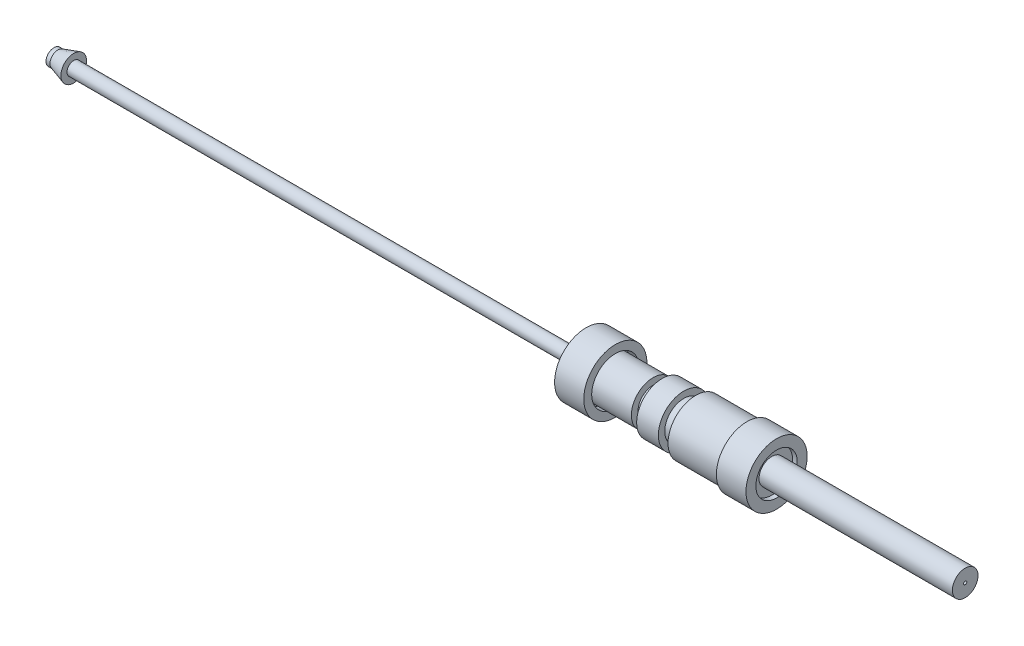
ISO-10303-21;
HEADER;
FILE_DESCRIPTION(('STEP AP214'),'2;1');
FILE_NAME('part.step','',(''),(''),'','','');
FILE_SCHEMA(('AUTOMOTIVE_DESIGN { 1 0 10303 214 1 1 1 1 }'));
ENDSEC;
DATA;
#1=APPLICATION_CONTEXT('core data for automotive mechanical design processes');
#2=APPLICATION_PROTOCOL_DEFINITION('international standard','automotive_design',2000,#1);
#3=PRODUCT_CONTEXT('',#1,'mechanical');
#4=PRODUCT('Part','Part','',(#3));
#5=PRODUCT_RELATED_PRODUCT_CATEGORY('part','',(#4));
#6=PRODUCT_DEFINITION_FORMATION('','',#4);
#7=PRODUCT_DEFINITION_CONTEXT('part definition',#1,'design');
#8=PRODUCT_DEFINITION('design','',#6,#7);
#9=PRODUCT_DEFINITION_SHAPE('','',#8);
#10=(LENGTH_UNIT() NAMED_UNIT(*) SI_UNIT(.MILLI.,.METRE.));
#11=(NAMED_UNIT(*) PLANE_ANGLE_UNIT() SI_UNIT($,.RADIAN.));
#12=(NAMED_UNIT(*) SI_UNIT($,.STERADIAN.) SOLID_ANGLE_UNIT());
#13=UNCERTAINTY_MEASURE_WITH_UNIT(LENGTH_MEASURE(1.E-05),#10,'distance_accuracy_value','');
#14=(GEOMETRIC_REPRESENTATION_CONTEXT(3) GLOBAL_UNCERTAINTY_ASSIGNED_CONTEXT((#13)) GLOBAL_UNIT_ASSIGNED_CONTEXT((#10,
#11,#12)) REPRESENTATION_CONTEXT('',''));
#15=CARTESIAN_POINT('',(0.,0.,0.));
#16=DIRECTION('',(0.,0.,1.));
#17=DIRECTION('',(1.,0.,0.));
#18=AXIS2_PLACEMENT_3D('',#15,#16,#17);
#19=CARTESIAN_POINT('',(209.759322266684,0.,0.));
#20=DIRECTION('',(1.,0.,0.));
#21=DIRECTION('',(0.,0.,-1.));
#22=AXIS2_PLACEMENT_3D('',#19,#20,#21);
#23=PLANE('',#22);
#24=CARTESIAN_POINT('',(209.759322266684,-148.573704322227,0.));
#25=DIRECTION('',(-1.,0.,0.));
#26=DIRECTION('',(0.,0.,1.));
#27=AXIS2_PLACEMENT_3D('',#24,#25,#26);
#28=CIRCLE('',#27,1.70000000000001);
#29=CARTESIAN_POINT('',(209.759322266684,-148.573704322227,1.70000000000001));
#30=VERTEX_POINT('',#29);
#31=EDGE_CURVE('E103',#30,#30,#28,.T.);
#32=ORIENTED_EDGE('',*,*,#31,.F.);
#33=EDGE_LOOP('',(#32));
#34=FACE_BOUND('',#33,.T.);
#35=CARTESIAN_POINT('',(209.759322266684,-148.573704322227,0.));
#36=DIRECTION('',(-1.,0.,0.));
#37=DIRECTION('',(0.,0.,1.));
#38=AXIS2_PLACEMENT_3D('',#35,#36,#37);
#39=CIRCLE('',#38,3.25);
#40=CARTESIAN_POINT('',(209.759322266684,-148.573704322227,3.25));
#41=VERTEX_POINT('',#40);
#42=EDGE_CURVE('E148',#41,#41,#39,.T.);
#43=ORIENTED_EDGE('',*,*,#42,.T.);
#44=EDGE_LOOP('',(#43));
#45=FACE_BOUND('',#44,.T.);
#46=ADVANCED_FACE('F32',(#34,#45),#23,.F.);
#47=CARTESIAN_POINT('',(227.370475165962,-148.573704322227,0.));
#48=DIRECTION('',(-1.,0.,0.));
#49=DIRECTION('',(0.,0.,1.));
#50=AXIS2_PLACEMENT_3D('',#47,#48,#49);
#51=CYLINDRICAL_SURFACE('',#50,3.25);
#52=CARTESIAN_POINT('',(300.659322266684,-148.573704322227,0.));
#53=DIRECTION('',(-1.,0.,0.));
#54=DIRECTION('',(0.,0.,1.));
#55=AXIS2_PLACEMENT_3D('',#52,#53,#54);
#56=CIRCLE('',#55,3.25);
#57=CARTESIAN_POINT('',(300.659322266684,-148.573704322227,3.25));
#58=VERTEX_POINT('',#57);
#59=EDGE_CURVE('E10',#58,#58,#56,.T.);
#60=ORIENTED_EDGE('',*,*,#59,.T.);
#61=EDGE_LOOP('',(#60));
#62=FACE_BOUND('',#61,.T.);
#63=CARTESIAN_POINT('',(251.659322266684,-148.573704322227,0.));
#64=DIRECTION('',(-1.,0.,0.));
#65=DIRECTION('',(0.,0.,1.));
#66=AXIS2_PLACEMENT_3D('',#63,#64,#65);
#67=CIRCLE('',#66,3.25);
#68=CARTESIAN_POINT('',(251.659322266684,-148.573704322227,3.25));
#69=VERTEX_POINT('',#68);
#70=EDGE_CURVE('E127',#69,#69,#67,.T.);
#71=ORIENTED_EDGE('',*,*,#70,.F.);
#72=EDGE_LOOP('',(#71));
#73=FACE_BOUND('',#72,.T.);
#74=ADVANCED_FACE('F34',(#62,#73),#51,.T.);
#75=CARTESIAN_POINT('',(300.659322266684,-145.323704322227,0.));
#76=DIRECTION('',(1.,0.,0.));
#77=DIRECTION('',(0.,0.,-1.));
#78=AXIS2_PLACEMENT_3D('',#75,#76,#77);
#79=PLANE('',#78);
#80=CARTESIAN_POINT('',(300.659322266684,-148.573704322227,0.));
#81=DIRECTION('',(-1.,0.,0.));
#82=DIRECTION('',(0.,0.,1.));
#83=AXIS2_PLACEMENT_3D('',#80,#81,#82);
#84=CIRCLE('',#83,0.400000000000011);
#85=CARTESIAN_POINT('',(300.659322266684,-148.573704322227,0.400000000000011));
#86=VERTEX_POINT('',#85);
#87=EDGE_CURVE('E39',#86,#86,#84,.T.);
#88=ORIENTED_EDGE('',*,*,#87,.T.);
#89=EDGE_LOOP('',(#88));
#90=FACE_BOUND('',#89,.T.);
#91=ORIENTED_EDGE('',*,*,#59,.F.);
#92=EDGE_LOOP('',(#91));
#93=FACE_BOUND('',#92,.T.);
#94=ADVANCED_FACE('F178',(#90,#93),#79,.T.);
#95=CARTESIAN_POINT('',(227.370475165962,-148.573704322227,0.));
#96=DIRECTION('',(-1.,0.,0.));
#97=DIRECTION('',(0.,0.,1.));
#98=AXIS2_PLACEMENT_3D('',#95,#96,#97);
#99=CYLINDRICAL_SURFACE('',#98,0.400000000000011);
#100=CARTESIAN_POINT('',(284.559322266684,-148.573704322227,0.));
#101=DIRECTION('',(-1.,0.,0.));
#102=DIRECTION('',(0.,0.,1.));
#103=AXIS2_PLACEMENT_3D('',#100,#101,#102);
#104=CIRCLE('',#103,0.400000000000011);
#105=CARTESIAN_POINT('',(284.559322266684,-148.573704322227,0.400000000000011));
#106=VERTEX_POINT('',#105);
#107=EDGE_CURVE('E43',#106,#106,#104,.T.);
#108=ORIENTED_EDGE('',*,*,#107,.T.);
#109=EDGE_LOOP('',(#108));
#110=FACE_BOUND('',#109,.T.);
#111=ORIENTED_EDGE('',*,*,#87,.F.);
#112=EDGE_LOOP('',(#111));
#113=FACE_BOUND('',#112,.T.);
#114=ADVANCED_FACE('F252',(#110,#113),#99,.F.);
#115=CARTESIAN_POINT('',(284.559322266684,-148.173704322227,0.));
#116=DIRECTION('',(-1.,0.,0.));
#117=DIRECTION('',(0.,0.,1.));
#118=AXIS2_PLACEMENT_3D('',#115,#116,#117);
#119=PLANE('',#118);
#120=CARTESIAN_POINT('',(284.559322266684,-148.573704322227,0.));
#121=DIRECTION('',(-1.,0.,0.));
#122=DIRECTION('',(0.,0.,1.));
#123=AXIS2_PLACEMENT_3D('',#120,#121,#122);
#124=CIRCLE('',#123,1.70245172341896);
#125=CARTESIAN_POINT('',(284.559322266684,-148.573704322227,1.70245172341896));
#126=VERTEX_POINT('',#125);
#127=EDGE_CURVE('E47',#126,#126,#124,.T.);
#128=ORIENTED_EDGE('',*,*,#127,.T.);
#129=EDGE_LOOP('',(#128));
#130=FACE_BOUND('',#129,.T.);
#131=ORIENTED_EDGE('',*,*,#107,.F.);
#132=EDGE_LOOP('',(#131));
#133=FACE_BOUND('',#132,.T.);
#134=ADVANCED_FACE('F248',(#130,#133),#119,.T.);
#135=CARTESIAN_POINT('',(284.559322266684,-148.573704322227,0.));
#136=DIRECTION('',(1.,0.,0.));
#137=DIRECTION('',(0.,0.,-1.));
#138=AXIS2_PLACEMENT_3D('',#135,#136,#137);
#139=CONICAL_SURFACE('',#138,1.70245172341896,4.81674541660942E-05);
#140=CARTESIAN_POINT('',(233.659322266684,-148.573704322227,0.));
#141=DIRECTION('',(-1.,0.,0.));
#142=DIRECTION('',(0.,0.,1.));
#143=AXIS2_PLACEMENT_3D('',#140,#141,#142);
#144=CIRCLE('',#143,1.70000000000001);
#145=CARTESIAN_POINT('',(233.659322266684,-148.573704322227,1.70000000000001));
#146=VERTEX_POINT('',#145);
#147=EDGE_CURVE('E52',#146,#146,#144,.T.);
#148=ORIENTED_EDGE('',*,*,#147,.T.);
#149=EDGE_LOOP('',(#148));
#150=FACE_BOUND('',#149,.T.);
#151=ORIENTED_EDGE('',*,*,#127,.F.);
#152=EDGE_LOOP('',(#151));
#153=FACE_BOUND('',#152,.T.);
#154=ADVANCED_FACE('F241',(#150,#153),#139,.F.);
#155=CARTESIAN_POINT('',(233.659322266684,0.,0.));
#156=DIRECTION('',(-1.,0.,0.));
#157=DIRECTION('',(0.,0.,1.));
#158=AXIS2_PLACEMENT_3D('',#155,#156,#157);
#159=PLANE('',#158);
#160=CARTESIAN_POINT('',(233.659322266684,-148.573704322227,0.));
#161=DIRECTION('',(-1.,0.,0.));
#162=DIRECTION('',(0.,0.,1.));
#163=AXIS2_PLACEMENT_3D('',#160,#161,#162);
#164=CIRCLE('',#163,0.404096618150496);
#165=CARTESIAN_POINT('',(233.659322266684,-148.573704322227,0.404096618150496));
#166=VERTEX_POINT('',#165);
#167=EDGE_CURVE('E55',#166,#166,#164,.T.);
#168=ORIENTED_EDGE('',*,*,#167,.T.);
#169=EDGE_LOOP('',(#168));
#170=FACE_BOUND('',#169,.T.);
#171=ORIENTED_EDGE('',*,*,#147,.F.);
#172=EDGE_LOOP('',(#171));
#173=FACE_BOUND('',#172,.T.);
#174=ADVANCED_FACE('F238',(#170,#173),#159,.F.);
#175=CARTESIAN_POINT('',(227.370475165962,-148.573704322227,0.));
#176=DIRECTION('',(-1.,0.,0.));
#177=DIRECTION('',(0.,0.,1.));
#178=AXIS2_PLACEMENT_3D('',#175,#176,#177);
#179=CYLINDRICAL_SURFACE('',#178,0.404096618150496);
#180=ORIENTED_EDGE('',*,*,#167,.F.);
#181=EDGE_LOOP('',(#180));
#182=FACE_BOUND('',#181,.T.);
#183=CARTESIAN_POINT('',(222.632765812238,-148.573704322227,0.));
#184=DIRECTION('',(-1.,0.,0.));
#185=DIRECTION('',(0.,0.,1.));
#186=AXIS2_PLACEMENT_3D('',#183,#184,#185);
#187=CIRCLE('',#186,0.404096618150496);
#188=CARTESIAN_POINT('',(222.632765812238,-148.573704322227,0.404096618150496));
#189=VERTEX_POINT('',#188);
#190=EDGE_CURVE('E100',#189,#189,#187,.T.);
#191=ORIENTED_EDGE('',*,*,#190,.T.);
#192=EDGE_LOOP('',(#191));
#193=FACE_BOUND('',#192,.T.);
#194=ADVANCED_FACE('F236',(#182,#193),#179,.F.);
#195=CARTESIAN_POINT('',(227.370475165962,-148.573704322227,0.));
#196=DIRECTION('',(-1.,0.,0.));
#197=DIRECTION('',(0.,0.,1.));
#198=AXIS2_PLACEMENT_3D('',#195,#196,#197);
#199=CYLINDRICAL_SURFACE('',#198,7.00000000000001);
#200=CARTESIAN_POINT('',(232.359322266684,-148.573704322227,0.));
#201=DIRECTION('',(-1.,0.,0.));
#202=DIRECTION('',(0.,0.,1.));
#203=AXIS2_PLACEMENT_3D('',#200,#201,#202);
#204=CIRCLE('',#203,7.00000000000001);
#205=CARTESIAN_POINT('',(232.359322266684,-148.573704322227,7.00000000000001));
#206=VERTEX_POINT('',#205);
#207=EDGE_CURVE('E58',#206,#206,#204,.T.);
#208=ORIENTED_EDGE('',*,*,#207,.F.);
#209=EDGE_LOOP('',(#208));
#210=FACE_BOUND('',#209,.T.);
#211=CARTESIAN_POINT('',(245.359322266684,-148.573704322227,0.));
#212=DIRECTION('',(1.,0.,0.));
#213=DIRECTION('',(0.,0.,-1.));
#214=AXIS2_PLACEMENT_3D('',#211,#212,#213);
#215=CIRCLE('',#214,7.00000000000001);
#216=CARTESIAN_POINT('',(245.359322266684,-148.573704322227,-7.00000000000001));
#217=VERTEX_POINT('',#216);
#218=EDGE_CURVE('E121',#217,#217,#215,.T.);
#219=ORIENTED_EDGE('',*,*,#218,.F.);
#220=EDGE_LOOP('',(#219));
#221=FACE_BOUND('',#220,.T.);
#222=ADVANCED_FACE('F232',(#210,#221),#199,.T.);
#223=CARTESIAN_POINT('',(232.359322266684,0.,0.));
#224=DIRECTION('',(1.,0.,0.));
#225=DIRECTION('',(0.,0.,-1.));
#226=AXIS2_PLACEMENT_3D('',#223,#224,#225);
#227=PLANE('',#226);
#228=CARTESIAN_POINT('',(232.359322266684,-148.573704322227,0.));
#229=DIRECTION('',(-1.,0.,0.));
#230=DIRECTION('',(0.,0.,1.));
#231=AXIS2_PLACEMENT_3D('',#228,#229,#230);
#232=CIRCLE('',#231,4.83456323534207);
#233=CARTESIAN_POINT('',(232.359322266684,-148.573704322227,4.83456323534207));
#234=VERTEX_POINT('',#233);
#235=EDGE_CURVE('E61',#234,#234,#232,.T.);
#236=ORIENTED_EDGE('',*,*,#235,.F.);
#237=EDGE_LOOP('',(#236));
#238=FACE_BOUND('',#237,.T.);
#239=ORIENTED_EDGE('',*,*,#207,.T.);
#240=EDGE_LOOP('',(#239));
#241=FACE_BOUND('',#240,.T.);
#242=ADVANCED_FACE('F228',(#238,#241),#227,.F.);
#243=CARTESIAN_POINT('',(227.370475165962,-148.573704322227,0.));
#244=DIRECTION('',(-1.,0.,0.));
#245=DIRECTION('',(0.,0.,1.));
#246=AXIS2_PLACEMENT_3D('',#243,#244,#245);
#247=CYLINDRICAL_SURFACE('',#246,4.83456323534207);
#248=CARTESIAN_POINT('',(229.359322266684,-148.573704322227,0.));
#249=DIRECTION('',(-1.,0.,0.));
#250=DIRECTION('',(0.,0.,1.));
#251=AXIS2_PLACEMENT_3D('',#248,#249,#250);
#252=CIRCLE('',#251,4.83456323534207);
#253=CARTESIAN_POINT('',(229.359322266684,-148.573704322227,4.83456323534207));
#254=VERTEX_POINT('',#253);
#255=EDGE_CURVE('E64',#254,#254,#252,.T.);
#256=ORIENTED_EDGE('',*,*,#255,.F.);
#257=EDGE_LOOP('',(#256));
#258=FACE_BOUND('',#257,.T.);
#259=ORIENTED_EDGE('',*,*,#235,.T.);
#260=EDGE_LOOP('',(#259));
#261=FACE_BOUND('',#260,.T.);
#262=ADVANCED_FACE('F224',(#258,#261),#247,.T.);
#263=CARTESIAN_POINT('',(229.359322266684,0.,0.));
#264=DIRECTION('',(-1.,0.,0.));
#265=DIRECTION('',(0.,0.,1.));
#266=AXIS2_PLACEMENT_3D('',#263,#264,#265);
#267=PLANE('',#266);
#268=CARTESIAN_POINT('',(229.359322266684,-148.573704322227,0.));
#269=DIRECTION('',(-1.,0.,0.));
#270=DIRECTION('',(0.,0.,1.));
#271=AXIS2_PLACEMENT_3D('',#268,#269,#270);
#272=CIRCLE('',#271,6.45619470370221);
#273=CARTESIAN_POINT('',(229.359322266684,-148.573704322227,6.45619470370221));
#274=VERTEX_POINT('',#273);
#275=EDGE_CURVE('E67',#274,#274,#272,.T.);
#276=ORIENTED_EDGE('',*,*,#275,.F.);
#277=EDGE_LOOP('',(#276));
#278=FACE_BOUND('',#277,.T.);
#279=ORIENTED_EDGE('',*,*,#255,.T.);
#280=EDGE_LOOP('',(#279));
#281=FACE_BOUND('',#280,.T.);
#282=ADVANCED_FACE('F220',(#278,#281),#267,.F.);
#283=CARTESIAN_POINT('',(227.370475165962,-148.573704322227,0.));
#284=DIRECTION('',(-1.,0.,0.));
#285=DIRECTION('',(0.,0.,1.));
#286=AXIS2_PLACEMENT_3D('',#283,#284,#285);
#287=CYLINDRICAL_SURFACE('',#286,6.45619470370221);
#288=CARTESIAN_POINT('',(223.859322266684,-148.573704322227,0.));
#289=DIRECTION('',(-1.,0.,0.));
#290=DIRECTION('',(0.,0.,1.));
#291=AXIS2_PLACEMENT_3D('',#288,#289,#290);
#292=CIRCLE('',#291,6.45619470370221);
#293=CARTESIAN_POINT('',(223.859322266684,-148.573704322227,6.45619470370221));
#294=VERTEX_POINT('',#293);
#295=EDGE_CURVE('E70',#294,#294,#292,.T.);
#296=ORIENTED_EDGE('',*,*,#295,.F.);
#297=EDGE_LOOP('',(#296));
#298=FACE_BOUND('',#297,.T.);
#299=ORIENTED_EDGE('',*,*,#275,.T.);
#300=EDGE_LOOP('',(#299));
#301=FACE_BOUND('',#300,.T.);
#302=ADVANCED_FACE('F216',(#298,#301),#287,.T.);
#303=CARTESIAN_POINT('',(223.859322266684,0.,0.));
#304=DIRECTION('',(1.,0.,0.));
#305=DIRECTION('',(0.,0.,-1.));
#306=AXIS2_PLACEMENT_3D('',#303,#304,#305);
#307=PLANE('',#306);
#308=CARTESIAN_POINT('',(223.859322266684,-148.573704322227,0.));
#309=DIRECTION('',(-1.,0.,0.));
#310=DIRECTION('',(0.,0.,1.));
#311=AXIS2_PLACEMENT_3D('',#308,#309,#310);
#312=CIRCLE('',#311,3.58825294136822);
#313=CARTESIAN_POINT('',(223.859322266684,-148.573704322227,3.58825294136822));
#314=VERTEX_POINT('',#313);
#315=EDGE_CURVE('E73',#314,#314,#312,.T.);
#316=ORIENTED_EDGE('',*,*,#315,.F.);
#317=EDGE_LOOP('',(#316));
#318=FACE_BOUND('',#317,.T.);
#319=ORIENTED_EDGE('',*,*,#295,.T.);
#320=EDGE_LOOP('',(#319));
#321=FACE_BOUND('',#320,.T.);
#322=ADVANCED_FACE('F212',(#318,#321),#307,.F.);
#323=CARTESIAN_POINT('',(227.370475165962,-148.573704322227,0.));
#324=DIRECTION('',(-1.,0.,0.));
#325=DIRECTION('',(0.,0.,1.));
#326=AXIS2_PLACEMENT_3D('',#323,#324,#325);
#327=CYLINDRICAL_SURFACE('',#326,3.58825294136822);
#328=CARTESIAN_POINT('',(223.646580113049,-148.573704322227,0.));
#329=DIRECTION('',(-1.,0.,0.));
#330=DIRECTION('',(0.,0.,1.));
#331=AXIS2_PLACEMENT_3D('',#328,#329,#330);
#332=CIRCLE('',#331,3.58825294136822);
#333=CARTESIAN_POINT('',(223.646580113049,-148.573704322227,3.58825294136822));
#334=VERTEX_POINT('',#333);
#335=EDGE_CURVE('E76',#334,#334,#332,.T.);
#336=ORIENTED_EDGE('',*,*,#335,.F.);
#337=EDGE_LOOP('',(#336));
#338=FACE_BOUND('',#337,.T.);
#339=ORIENTED_EDGE('',*,*,#315,.T.);
#340=EDGE_LOOP('',(#339));
#341=FACE_BOUND('',#340,.T.);
#342=ADVANCED_FACE('F208',(#338,#341),#327,.T.);
#343=CARTESIAN_POINT('',(223.646580113049,0.,0.));
#344=DIRECTION('',(-1.,0.,0.));
#345=DIRECTION('',(0.,0.,1.));
#346=AXIS2_PLACEMENT_3D('',#343,#344,#345);
#347=PLANE('',#346);
#348=CARTESIAN_POINT('',(223.646580113049,-148.573704322227,0.));
#349=DIRECTION('',(-1.,0.,0.));
#350=DIRECTION('',(0.,0.,1.));
#351=AXIS2_PLACEMENT_3D('',#348,#349,#350);
#352=CIRCLE('',#351,3.58968431332662);
#353=CARTESIAN_POINT('',(223.646580113049,-148.573704322227,3.58968431332662));
#354=VERTEX_POINT('',#353);
#355=EDGE_CURVE('E79',#354,#354,#352,.T.);
#356=ORIENTED_EDGE('',*,*,#355,.F.);
#357=EDGE_LOOP('',(#356));
#358=FACE_BOUND('',#357,.T.);
#359=ORIENTED_EDGE('',*,*,#335,.T.);
#360=EDGE_LOOP('',(#359));
#361=FACE_BOUND('',#360,.T.);
#362=ADVANCED_FACE('F204',(#358,#361),#347,.F.);
#363=CARTESIAN_POINT('',(227.370475165962,-148.573704322227,0.));
#364=DIRECTION('',(-1.,0.,0.));
#365=DIRECTION('',(0.,0.,1.));
#366=AXIS2_PLACEMENT_3D('',#363,#364,#365);
#367=CYLINDRICAL_SURFACE('',#366,3.58968431332662);
#368=CARTESIAN_POINT('',(222.39185735049,-148.573704322227,0.));
#369=DIRECTION('',(-1.,0.,0.));
#370=DIRECTION('',(0.,0.,1.));
#371=AXIS2_PLACEMENT_3D('',#368,#369,#370);
#372=CIRCLE('',#371,3.58968431332662);
#373=CARTESIAN_POINT('',(222.39185735049,-148.573704322227,3.58968431332662));
#374=VERTEX_POINT('',#373);
#375=EDGE_CURVE('E82',#374,#374,#372,.T.);
#376=ORIENTED_EDGE('',*,*,#375,.F.);
#377=EDGE_LOOP('',(#376));
#378=FACE_BOUND('',#377,.T.);
#379=ORIENTED_EDGE('',*,*,#355,.T.);
#380=EDGE_LOOP('',(#379));
#381=FACE_BOUND('',#380,.T.);
#382=ADVANCED_FACE('F200',(#378,#381),#367,.T.);
#383=CARTESIAN_POINT('',(222.39185735049,0.,0.));
#384=DIRECTION('',(-1.,0.,0.));
#385=DIRECTION('',(0.,0.,1.));
#386=AXIS2_PLACEMENT_3D('',#383,#384,#385);
#387=PLANE('',#386);
#388=CARTESIAN_POINT('',(222.39185735049,-148.573704322227,0.));
#389=DIRECTION('',(-1.,0.,0.));
#390=DIRECTION('',(0.,0.,1.));
#391=AXIS2_PLACEMENT_3D('',#388,#389,#390);
#392=CIRCLE('',#391,3.83026288109581);
#393=CARTESIAN_POINT('',(222.39185735049,-148.573704322227,3.83026288109581));
#394=VERTEX_POINT('',#393);
#395=EDGE_CURVE('E85',#394,#394,#392,.T.);
#396=ORIENTED_EDGE('',*,*,#395,.F.);
#397=EDGE_LOOP('',(#396));
#398=FACE_BOUND('',#397,.T.);
#399=ORIENTED_EDGE('',*,*,#375,.T.);
#400=EDGE_LOOP('',(#399));
#401=FACE_BOUND('',#400,.T.);
#402=ADVANCED_FACE('F196',(#398,#401),#387,.F.);
#403=CARTESIAN_POINT('',(227.370475165962,-148.573704322227,0.));
#404=DIRECTION('',(-1.,0.,0.));
#405=DIRECTION('',(0.,0.,1.));
#406=AXIS2_PLACEMENT_3D('',#403,#404,#405);
#407=CYLINDRICAL_SURFACE('',#406,3.83026288109581);
#408=CARTESIAN_POINT('',(221.559322266684,-148.573704322227,0.));
#409=DIRECTION('',(-1.,0.,0.));
#410=DIRECTION('',(0.,0.,1.));
#411=AXIS2_PLACEMENT_3D('',#408,#409,#410);
#412=CIRCLE('',#411,3.83026288109581);
#413=CARTESIAN_POINT('',(221.559322266684,-148.573704322227,3.83026288109581));
#414=VERTEX_POINT('',#413);
#415=EDGE_CURVE('E88',#414,#414,#412,.T.);
#416=ORIENTED_EDGE('',*,*,#415,.F.);
#417=EDGE_LOOP('',(#416));
#418=FACE_BOUND('',#417,.T.);
#419=ORIENTED_EDGE('',*,*,#395,.T.);
#420=EDGE_LOOP('',(#419));
#421=FACE_BOUND('',#420,.T.);
#422=ADVANCED_FACE('F192',(#418,#421),#407,.T.);
#423=CARTESIAN_POINT('',(221.559322266684,0.,0.));
#424=DIRECTION('',(-1.,0.,0.));
#425=DIRECTION('',(0.,0.,1.));
#426=AXIS2_PLACEMENT_3D('',#423,#424,#425);
#427=PLANE('',#426);
#428=CARTESIAN_POINT('',(221.559322266684,-148.573704322227,0.));
#429=DIRECTION('',(-1.,0.,0.));
#430=DIRECTION('',(0.,0.,1.));
#431=AXIS2_PLACEMENT_3D('',#428,#429,#430);
#432=CIRCLE('',#431,5.50000000000001);
#433=CARTESIAN_POINT('',(221.559322266684,-148.573704322227,5.50000000000001));
#434=VERTEX_POINT('',#433);
#435=EDGE_CURVE('E91',#434,#434,#432,.T.);
#436=ORIENTED_EDGE('',*,*,#435,.F.);
#437=EDGE_LOOP('',(#436));
#438=FACE_BOUND('',#437,.T.);
#439=ORIENTED_EDGE('',*,*,#415,.T.);
#440=EDGE_LOOP('',(#439));
#441=FACE_BOUND('',#440,.T.);
#442=ADVANCED_FACE('F188',(#438,#441),#427,.F.);
#443=CARTESIAN_POINT('',(227.370475165962,-148.573704322227,0.));
#444=DIRECTION('',(-1.,0.,0.));
#445=DIRECTION('',(0.,0.,1.));
#446=AXIS2_PLACEMENT_3D('',#443,#444,#445);
#447=CYLINDRICAL_SURFACE('',#446,5.50000000000001);
#448=CARTESIAN_POINT('',(209.759322266684,-148.573704322227,0.));
#449=DIRECTION('',(-1.,0.,0.));
#450=DIRECTION('',(0.,0.,1.));
#451=AXIS2_PLACEMENT_3D('',#448,#449,#450);
#452=CIRCLE('',#451,5.50000000000001);
#453=CARTESIAN_POINT('',(209.759322266684,-148.573704322227,5.50000000000001));
#454=VERTEX_POINT('',#453);
#455=EDGE_CURVE('E94',#454,#454,#452,.T.);
#456=ORIENTED_EDGE('',*,*,#455,.F.);
#457=EDGE_LOOP('',(#456));
#458=FACE_BOUND('',#457,.T.);
#459=ORIENTED_EDGE('',*,*,#435,.T.);
#460=EDGE_LOOP('',(#459));
#461=FACE_BOUND('',#460,.T.);
#462=ADVANCED_FACE('F185',(#458,#461),#447,.T.);
#463=CARTESIAN_POINT('',(227.370475165962,-148.573704322227,0.));
#464=DIRECTION('',(-1.,0.,0.));
#465=DIRECTION('',(0.,0.,1.));
#466=AXIS2_PLACEMENT_3D('',#463,#464,#465);
#467=CYLINDRICAL_SURFACE('',#466,0.84999999999999);
#468=CARTESIAN_POINT('',(222.632765812238,-148.573704322227,0.));
#469=DIRECTION('',(-1.,0.,0.));
#470=DIRECTION('',(0.,0.,1.));
#471=AXIS2_PLACEMENT_3D('',#468,#469,#470);
#472=CIRCLE('',#471,0.84999999999999);
#473=CARTESIAN_POINT('',(222.632765812238,-148.573704322227,0.84999999999999));
#474=VERTEX_POINT('',#473);
#475=EDGE_CURVE('E97',#474,#474,#472,.T.);
#476=ORIENTED_EDGE('',*,*,#475,.F.);
#477=EDGE_LOOP('',(#476));
#478=FACE_BOUND('',#477,.T.);
#479=CARTESIAN_POINT('',(69.7593222666838,-148.573704322227,0.));
#480=DIRECTION('',(-1.,0.,0.));
#481=DIRECTION('',(0.,0.,1.));
#482=AXIS2_PLACEMENT_3D('',#479,#480,#481);
#483=CIRCLE('',#482,0.849999999999962);
#484=CARTESIAN_POINT('',(69.7593222666838,-148.573704322227,0.849999999999962));
#485=VERTEX_POINT('',#484);
#486=EDGE_CURVE('E118',#485,#485,#483,.T.);
#487=ORIENTED_EDGE('',*,*,#486,.T.);
#488=EDGE_LOOP('',(#487));
#489=FACE_BOUND('',#488,.T.);
#490=ADVANCED_FACE('F183',(#478,#489),#467,.F.);
#491=CARTESIAN_POINT('',(222.632765812238,0.,0.));
#492=DIRECTION('',(1.,0.,0.));
#493=DIRECTION('',(0.,0.,-1.));
#494=AXIS2_PLACEMENT_3D('',#491,#492,#493);
#495=PLANE('',#494);
#496=ORIENTED_EDGE('',*,*,#190,.F.);
#497=EDGE_LOOP('',(#496));
#498=FACE_BOUND('',#497,.T.);
#499=ORIENTED_EDGE('',*,*,#475,.T.);
#500=EDGE_LOOP('',(#499));
#501=FACE_BOUND('',#500,.T.);
#502=ADVANCED_FACE('F341',(#498,#501),#495,.F.);
#503=CARTESIAN_POINT('',(227.370475165962,-148.573704322227,0.));
#504=DIRECTION('',(-1.,0.,0.));
#505=DIRECTION('',(0.,0.,1.));
#506=AXIS2_PLACEMENT_3D('',#503,#504,#505);
#507=CYLINDRICAL_SURFACE('',#506,1.70000000000001);
#508=ORIENTED_EDGE('',*,*,#31,.T.);
#509=EDGE_LOOP('',(#508));
#510=FACE_BOUND('',#509,.T.);
#511=CARTESIAN_POINT('',(74.7593222666838,-148.573704322227,0.));
#512=DIRECTION('',(-1.,0.,0.));
#513=DIRECTION('',(0.,0.,1.));
#514=AXIS2_PLACEMENT_3D('',#511,#512,#513);
#515=CIRCLE('',#514,1.70000000000001);
#516=CARTESIAN_POINT('',(74.7593222666838,-148.573704322227,1.70000000000001));
#517=VERTEX_POINT('',#516);
#518=EDGE_CURVE('E106',#517,#517,#515,.T.);
#519=ORIENTED_EDGE('',*,*,#518,.F.);
#520=EDGE_LOOP('',(#519));
#521=FACE_BOUND('',#520,.T.);
#522=ADVANCED_FACE('F348',(#510,#521),#507,.T.);
#523=CARTESIAN_POINT('',(74.7593222666838,0.,0.));
#524=DIRECTION('',(-1.,0.,0.));
#525=DIRECTION('',(0.,0.,1.));
#526=AXIS2_PLACEMENT_3D('',#523,#524,#525);
#527=PLANE('',#526);
#528=CARTESIAN_POINT('',(74.7593222666838,-148.573704322227,0.));
#529=DIRECTION('',(-1.,0.,0.));
#530=DIRECTION('',(0.,0.,1.));
#531=AXIS2_PLACEMENT_3D('',#528,#529,#530);
#532=CIRCLE('',#531,3.25);
#533=CARTESIAN_POINT('',(74.7593222666838,-148.573704322227,3.25));
#534=VERTEX_POINT('',#533);
#535=EDGE_CURVE('E109',#534,#534,#532,.T.);
#536=ORIENTED_EDGE('',*,*,#535,.F.);
#537=EDGE_LOOP('',(#536));
#538=FACE_BOUND('',#537,.T.);
#539=ORIENTED_EDGE('',*,*,#518,.T.);
#540=EDGE_LOOP('',(#539));
#541=FACE_BOUND('',#540,.T.);
#542=ADVANCED_FACE('F354',(#538,#541),#527,.F.);
#543=CARTESIAN_POINT('',(74.7593222666838,-148.573704322227,0.));
#544=DIRECTION('',(1.,0.,0.));
#545=DIRECTION('',(0.,0.,-1.));
#546=AXIS2_PLACEMENT_3D('',#543,#544,#545);
#547=CONICAL_SURFACE('',#546,3.25,0.297492468760547);
#548=CARTESIAN_POINT('',(70.7593222666838,-148.573704322227,0.));
#549=DIRECTION('',(-1.,0.,0.));
#550=DIRECTION('',(0.,0.,1.));
#551=AXIS2_PLACEMENT_3D('',#548,#549,#550);
#552=CIRCLE('',#551,2.02363640336573);
#553=CARTESIAN_POINT('',(70.7593222666838,-148.573704322227,2.02363640336573));
#554=VERTEX_POINT('',#553);
#555=EDGE_CURVE('E112',#554,#554,#552,.T.);
#556=ORIENTED_EDGE('',*,*,#555,.F.);
#557=EDGE_LOOP('',(#556));
#558=FACE_BOUND('',#557,.T.);
#559=ORIENTED_EDGE('',*,*,#535,.T.);
#560=EDGE_LOOP('',(#559));
#561=FACE_BOUND('',#560,.T.);
#562=ADVANCED_FACE('F362',(#558,#561),#547,.T.);
#563=CARTESIAN_POINT('',(227.370475165962,-148.573704322227,0.));
#564=DIRECTION('',(-1.,0.,0.));
#565=DIRECTION('',(0.,0.,1.));
#566=AXIS2_PLACEMENT_3D('',#563,#564,#565);
#567=CYLINDRICAL_SURFACE('',#566,2.02363640336574);
#568=CARTESIAN_POINT('',(69.7593222666838,-148.573704322227,0.));
#569=DIRECTION('',(-1.,0.,0.));
#570=DIRECTION('',(0.,0.,1.));
#571=AXIS2_PLACEMENT_3D('',#568,#569,#570);
#572=CIRCLE('',#571,2.02363640336575);
#573=CARTESIAN_POINT('',(69.7593222666838,-148.573704322227,2.02363640336575));
#574=VERTEX_POINT('',#573);
#575=EDGE_CURVE('E115',#574,#574,#572,.T.);
#576=ORIENTED_EDGE('',*,*,#575,.F.);
#577=EDGE_LOOP('',(#576));
#578=FACE_BOUND('',#577,.T.);
#579=ORIENTED_EDGE('',*,*,#555,.T.);
#580=EDGE_LOOP('',(#579));
#581=FACE_BOUND('',#580,.T.);
#582=ADVANCED_FACE('F370',(#578,#581),#567,.T.);
#583=CARTESIAN_POINT('',(69.7593222666838,2.99133552951936E-12,0.));
#584=DIRECTION('',(1.,0.,0.));
#585=DIRECTION('',(0.,0.,-1.));
#586=AXIS2_PLACEMENT_3D('',#583,#584,#585);
#587=PLANE('',#586);
#588=ORIENTED_EDGE('',*,*,#486,.F.);
#589=EDGE_LOOP('',(#588));
#590=FACE_BOUND('',#589,.T.);
#591=ORIENTED_EDGE('',*,*,#575,.T.);
#592=EDGE_LOOP('',(#591));
#593=FACE_BOUND('',#592,.T.);
#594=ADVANCED_FACE('F378',(#590,#593),#587,.F.);
#595=CARTESIAN_POINT('',(227.370475165962,-148.573704322227,0.));
#596=DIRECTION('',(-1.,0.,0.));
#597=DIRECTION('',(0.,0.,1.));
#598=AXIS2_PLACEMENT_3D('',#595,#596,#597);
#599=CYLINDRICAL_SURFACE('',#598,7.75000000000001);
#600=CARTESIAN_POINT('',(245.359322266684,-148.573704322227,0.));
#601=DIRECTION('',(-1.,0.,0.));
#602=DIRECTION('',(0.,0.,1.));
#603=AXIS2_PLACEMENT_3D('',#600,#601,#602);
#604=CIRCLE('',#603,7.75000000000001);
#605=CARTESIAN_POINT('',(245.359322266684,-148.573704322227,7.75000000000001));
#606=VERTEX_POINT('',#605);
#607=EDGE_CURVE('E124',#606,#606,#604,.T.);
#608=ORIENTED_EDGE('',*,*,#607,.F.);
#609=EDGE_LOOP('',(#608));
#610=FACE_BOUND('',#609,.T.);
#611=CARTESIAN_POINT('',(252.859322266684,-148.573704322227,0.));
#612=DIRECTION('',(-1.,0.,0.));
#613=DIRECTION('',(0.,0.,1.));
#614=AXIS2_PLACEMENT_3D('',#611,#612,#613);
#615=CIRCLE('',#614,7.75000000000001);
#616=CARTESIAN_POINT('',(252.859322266684,-148.573704322227,7.75000000000001));
#617=VERTEX_POINT('',#616);
#618=EDGE_CURVE('E136',#617,#617,#615,.T.);
#619=ORIENTED_EDGE('',*,*,#618,.T.);
#620=EDGE_LOOP('',(#619));
#621=FACE_BOUND('',#620,.T.);
#622=ADVANCED_FACE('F386',(#610,#621),#599,.T.);
#623=CARTESIAN_POINT('',(245.359322266684,0.,0.));
#624=DIRECTION('',(1.,0.,0.));
#625=DIRECTION('',(0.,0.,-1.));
#626=AXIS2_PLACEMENT_3D('',#623,#624,#625);
#627=PLANE('',#626);
#628=ORIENTED_EDGE('',*,*,#218,.T.);
#629=EDGE_LOOP('',(#628));
#630=FACE_BOUND('',#629,.T.);
#631=ORIENTED_EDGE('',*,*,#607,.T.);
#632=EDGE_LOOP('',(#631));
#633=FACE_BOUND('',#632,.T.);
#634=ADVANCED_FACE('F394',(#630,#633),#627,.F.);
#635=CARTESIAN_POINT('',(251.659322266684,0.,0.));
#636=DIRECTION('',(-1.,0.,0.));
#637=DIRECTION('',(0.,0.,1.));
#638=AXIS2_PLACEMENT_3D('',#635,#636,#637);
#639=PLANE('',#638);
#640=CARTESIAN_POINT('',(251.659322266684,-148.573704322227,0.));
#641=DIRECTION('',(-1.,0.,0.));
#642=DIRECTION('',(0.,0.,1.));
#643=AXIS2_PLACEMENT_3D('',#640,#641,#642);
#644=CIRCLE('',#643,5.25);
#645=CARTESIAN_POINT('',(251.659322266684,-148.573704322227,5.25));
#646=VERTEX_POINT('',#645);
#647=EDGE_CURVE('E130',#646,#646,#644,.T.);
#648=ORIENTED_EDGE('',*,*,#647,.F.);
#649=EDGE_LOOP('',(#648));
#650=FACE_BOUND('',#649,.T.);
#651=ORIENTED_EDGE('',*,*,#70,.T.);
#652=EDGE_LOOP('',(#651));
#653=FACE_BOUND('',#652,.T.);
#654=ADVANCED_FACE('F402',(#650,#653),#639,.F.);
#655=CARTESIAN_POINT('',(227.370475165962,-148.573704322227,0.));
#656=DIRECTION('',(-1.,0.,0.));
#657=DIRECTION('',(0.,0.,1.));
#658=AXIS2_PLACEMENT_3D('',#655,#656,#657);
#659=CYLINDRICAL_SURFACE('',#658,5.25);
#660=CARTESIAN_POINT('',(252.859322266684,-148.573704322227,0.));
#661=DIRECTION('',(-1.,0.,0.));
#662=DIRECTION('',(0.,0.,1.));
#663=AXIS2_PLACEMENT_3D('',#660,#661,#662);
#664=CIRCLE('',#663,5.25);
#665=CARTESIAN_POINT('',(252.859322266684,-148.573704322227,5.25));
#666=VERTEX_POINT('',#665);
#667=EDGE_CURVE('E133',#666,#666,#664,.T.);
#668=ORIENTED_EDGE('',*,*,#667,.F.);
#669=EDGE_LOOP('',(#668));
#670=FACE_BOUND('',#669,.T.);
#671=ORIENTED_EDGE('',*,*,#647,.T.);
#672=EDGE_LOOP('',(#671));
#673=FACE_BOUND('',#672,.T.);
#674=ADVANCED_FACE('F410',(#670,#673),#659,.F.);
#675=CARTESIAN_POINT('',(252.859322266684,0.,0.));
#676=DIRECTION('',(-1.,0.,0.));
#677=DIRECTION('',(0.,0.,1.));
#678=AXIS2_PLACEMENT_3D('',#675,#676,#677);
#679=PLANE('',#678);
#680=ORIENTED_EDGE('',*,*,#618,.F.);
#681=EDGE_LOOP('',(#680));
#682=FACE_BOUND('',#681,.T.);
#683=ORIENTED_EDGE('',*,*,#667,.T.);
#684=EDGE_LOOP('',(#683));
#685=FACE_BOUND('',#684,.T.);
#686=ADVANCED_FACE('F418',(#682,#685),#679,.F.);
#687=CARTESIAN_POINT('',(212.009322266684,0.,0.));
#688=DIRECTION('',(1.,0.,0.));
#689=DIRECTION('',(0.,0.,-1.));
#690=AXIS2_PLACEMENT_3D('',#687,#688,#689);
#691=PLANE('',#690);
#692=CARTESIAN_POINT('',(212.009322266684,-148.573704322227,0.));
#693=DIRECTION('',(-1.,0.,0.));
#694=DIRECTION('',(0.,0.,1.));
#695=AXIS2_PLACEMENT_3D('',#692,#693,#694);
#696=CIRCLE('',#695,6.00000000000001);
#697=CARTESIAN_POINT('',(212.009322266684,-148.573704322227,6.00000000000001));
#698=VERTEX_POINT('',#697);
#699=EDGE_CURVE('E154',#698,#698,#696,.T.);
#700=ORIENTED_EDGE('',*,*,#699,.T.);
#701=EDGE_LOOP('',(#700));
#702=FACE_BOUND('',#701,.T.);
#703=CARTESIAN_POINT('',(212.009322266684,-148.573704322227,0.));
#704=DIRECTION('',(-1.,0.,0.));
#705=DIRECTION('',(0.,0.,1.));
#706=AXIS2_PLACEMENT_3D('',#703,#704,#705);
#707=CIRCLE('',#706,8.00000000000001);
#708=CARTESIAN_POINT('',(212.009322266684,-148.573704322227,8.00000000000001));
#709=VERTEX_POINT('',#708);
#710=EDGE_CURVE('E139',#709,#709,#707,.T.);
#711=ORIENTED_EDGE('',*,*,#710,.F.);
#712=EDGE_LOOP('',(#711));
#713=FACE_BOUND('',#712,.T.);
#714=ADVANCED_FACE('F158',(#702,#713),#691,.T.);
#715=CARTESIAN_POINT('',(227.370475165962,-148.573704322227,0.));
#716=DIRECTION('',(-1.,0.,0.));
#717=DIRECTION('',(0.,0.,1.));
#718=AXIS2_PLACEMENT_3D('',#715,#716,#717);
#719=CYLINDRICAL_SURFACE('',#718,8.00000000000001);
#720=ORIENTED_EDGE('',*,*,#710,.T.);
#721=EDGE_LOOP('',(#720));
#722=FACE_BOUND('',#721,.T.);
#723=CARTESIAN_POINT('',(204.609322266684,-148.573704322227,0.));
#724=DIRECTION('',(-1.,0.,0.));
#725=DIRECTION('',(0.,0.,1.));
#726=AXIS2_PLACEMENT_3D('',#723,#724,#725);
#727=CIRCLE('',#726,8.00000000000001);
#728=CARTESIAN_POINT('',(204.609322266684,-148.573704322227,8.00000000000001));
#729=VERTEX_POINT('',#728);
#730=EDGE_CURVE('E142',#729,#729,#727,.T.);
#731=ORIENTED_EDGE('',*,*,#730,.F.);
#732=EDGE_LOOP('',(#731));
#733=FACE_BOUND('',#732,.T.);
#734=ADVANCED_FACE('F433',(#722,#733),#719,.T.);
#735=CARTESIAN_POINT('',(204.609322266684,0.,0.));
#736=DIRECTION('',(-1.,0.,0.));
#737=DIRECTION('',(0.,0.,1.));
#738=AXIS2_PLACEMENT_3D('',#735,#736,#737);
#739=PLANE('',#738);
#740=ORIENTED_EDGE('',*,*,#730,.T.);
#741=EDGE_LOOP('',(#740));
#742=FACE_BOUND('',#741,.T.);
#743=CARTESIAN_POINT('',(204.609322266684,-148.573704322227,0.));
#744=DIRECTION('',(-1.,0.,0.));
#745=DIRECTION('',(0.,0.,1.));
#746=AXIS2_PLACEMENT_3D('',#743,#744,#745);
#747=CIRCLE('',#746,3.25);
#748=CARTESIAN_POINT('',(204.609322266684,-148.573704322227,3.25));
#749=VERTEX_POINT('',#748);
#750=EDGE_CURVE('E145',#749,#749,#747,.T.);
#751=ORIENTED_EDGE('',*,*,#750,.F.);
#752=EDGE_LOOP('',(#751));
#753=FACE_BOUND('',#752,.T.);
#754=ADVANCED_FACE('F440',(#742,#753),#739,.T.);
#755=CARTESIAN_POINT('',(227.370475165962,-148.573704322227,0.));
#756=DIRECTION('',(-1.,0.,0.));
#757=DIRECTION('',(0.,0.,1.));
#758=AXIS2_PLACEMENT_3D('',#755,#756,#757);
#759=CYLINDRICAL_SURFACE('',#758,3.25);
#760=ORIENTED_EDGE('',*,*,#750,.T.);
#761=EDGE_LOOP('',(#760));
#762=FACE_BOUND('',#761,.T.);
#763=ORIENTED_EDGE('',*,*,#42,.F.);
#764=EDGE_LOOP('',(#763));
#765=FACE_BOUND('',#764,.T.);
#766=ADVANCED_FACE('F169',(#762,#765),#759,.F.);
#767=CARTESIAN_POINT('',(209.759322266684,0.,0.));
#768=DIRECTION('',(1.,0.,0.));
#769=DIRECTION('',(0.,0.,-1.));
#770=AXIS2_PLACEMENT_3D('',#767,#768,#769);
#771=PLANE('',#770);
#772=ORIENTED_EDGE('',*,*,#455,.T.);
#773=EDGE_LOOP('',(#772));
#774=FACE_BOUND('',#773,.T.);
#775=CARTESIAN_POINT('',(209.759322266684,-148.573704322227,0.));
#776=DIRECTION('',(-1.,0.,0.));
#777=DIRECTION('',(0.,0.,1.));
#778=AXIS2_PLACEMENT_3D('',#775,#776,#777);
#779=CIRCLE('',#778,6.00000000000001);
#780=CARTESIAN_POINT('',(209.759322266684,-148.573704322227,6.00000000000001));
#781=VERTEX_POINT('',#780);
#782=EDGE_CURVE('E151',#781,#781,#779,.T.);
#783=ORIENTED_EDGE('',*,*,#782,.F.);
#784=EDGE_LOOP('',(#783));
#785=FACE_BOUND('',#784,.T.);
#786=ADVANCED_FACE('F163',(#774,#785),#771,.T.);
#787=CARTESIAN_POINT('',(227.370475165962,-148.573704322227,0.));
#788=DIRECTION('',(-1.,0.,0.));
#789=DIRECTION('',(0.,0.,1.));
#790=AXIS2_PLACEMENT_3D('',#787,#788,#789);
#791=CYLINDRICAL_SURFACE('',#790,6.00000000000001);
#792=ORIENTED_EDGE('',*,*,#782,.T.);
#793=EDGE_LOOP('',(#792));
#794=FACE_BOUND('',#793,.T.);
#795=ORIENTED_EDGE('',*,*,#699,.F.);
#796=EDGE_LOOP('',(#795));
#797=FACE_BOUND('',#796,.T.);
#798=ADVANCED_FACE('F161',(#794,#797),#791,.F.);
#799=CLOSED_SHELL('',(#46,#74,#94,#114,#134,#154,#174,#194,#222,#242,#262,#282,#302,#322,#342,
#362,#382,#402,#422,#442,#462,#490,#502,#522,#542,#562,#582,#594,#622,#634,#654,#674,#686,#714,
#734,#754,#766,#786,#798));
#800=MANIFOLD_SOLID_BREP('B2',#799);
#801=ADVANCED_BREP_SHAPE_REPRESENTATION('',(#18,#800),#14);
#802=SHAPE_DEFINITION_REPRESENTATION(#9,#801);
ENDSEC;
END-ISO-10303-21;
